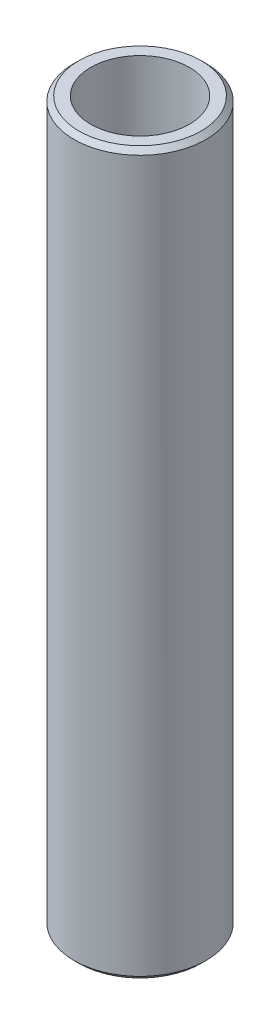
ISO-10303-21;
HEADER;
FILE_DESCRIPTION(('STEP AP214'),'2;1');
FILE_NAME('part.step','',(''),(''),'','','');
FILE_SCHEMA(('AUTOMOTIVE_DESIGN { 1 0 10303 214 1 1 1 1 }'));
ENDSEC;
DATA;
#1=APPLICATION_CONTEXT('core data for automotive mechanical design processes');
#2=APPLICATION_PROTOCOL_DEFINITION('international standard','automotive_design',2000,#1);
#3=PRODUCT_CONTEXT('',#1,'mechanical');
#4=PRODUCT('Part','Part','',(#3));
#5=PRODUCT_RELATED_PRODUCT_CATEGORY('part','',(#4));
#6=PRODUCT_DEFINITION_FORMATION('','',#4);
#7=PRODUCT_DEFINITION_CONTEXT('part definition',#1,'design');
#8=PRODUCT_DEFINITION('design','',#6,#7);
#9=PRODUCT_DEFINITION_SHAPE('','',#8);
#10=(LENGTH_UNIT() NAMED_UNIT(*) SI_UNIT(.MILLI.,.METRE.));
#11=(NAMED_UNIT(*) PLANE_ANGLE_UNIT() SI_UNIT($,.RADIAN.));
#12=(NAMED_UNIT(*) SI_UNIT($,.STERADIAN.) SOLID_ANGLE_UNIT());
#13=UNCERTAINTY_MEASURE_WITH_UNIT(LENGTH_MEASURE(1.E-05),#10,'distance_accuracy_value','');
#14=(GEOMETRIC_REPRESENTATION_CONTEXT(3) GLOBAL_UNCERTAINTY_ASSIGNED_CONTEXT((#13)) GLOBAL_UNIT_ASSIGNED_CONTEXT((#10,
#11,#12)) REPRESENTATION_CONTEXT('',''));
#15=CARTESIAN_POINT('',(0.,0.,0.));
#16=DIRECTION('',(0.,0.,1.));
#17=DIRECTION('',(1.,0.,0.));
#18=AXIS2_PLACEMENT_3D('',#15,#16,#17);
#19=CARTESIAN_POINT('',(0.,491.695548874802,0.));
#20=DIRECTION('',(0.,-1.,0.));
#21=DIRECTION('',(0.,0.,-1.));
#22=AXIS2_PLACEMENT_3D('',#19,#20,#21);
#23=CYLINDRICAL_SURFACE('',#22,45.);
#24=CARTESIAN_POINT('',(0.,488.3638529157,0.));
#25=DIRECTION('',(0.,1.,0.));
#26=DIRECTION('',(0.,0.,1.));
#27=AXIS2_PLACEMENT_3D('',#24,#25,#26);
#28=CIRCLE('',#27,45.);
#29=CARTESIAN_POINT('',(0.,488.3638529157,-45.));
#30=VERTEX_POINT('',#29);
#31=EDGE_CURVE('E50',#30,#30,#28,.F.);
#32=CARTESIAN_POINT('',(0.,3.33169595910243,0.));
#33=DIRECTION('',(0.,1.,0.));
#34=DIRECTION('',(0.,0.,1.));
#35=AXIS2_PLACEMENT_3D('',#32,#33,#34);
#36=CIRCLE('',#35,45.);
#37=CARTESIAN_POINT('',(0.,3.33169595910243,-45.));
#38=VERTEX_POINT('',#37);
#39=EDGE_CURVE('E51',#38,#38,#36,.T.);
#40=CARTESIAN_POINT('',(0.,488.3638529157,-45.));
#41=CARTESIAN_POINT('',(0.,483.311434614068,-45.));
#42=CARTESIAN_POINT('',(0.,478.259016312437,-45.));
#43=CARTESIAN_POINT('',(0.,468.154179709175,-45.));
#44=CARTESIAN_POINT('',(0.,463.101761407544,-45.));
#45=CARTESIAN_POINT('',(0.,452.996924804281,-45.));
#46=CARTESIAN_POINT('',(0.,447.94450650265,-45.));
#47=CARTESIAN_POINT('',(0.,437.839669899388,-45.));
#48=CARTESIAN_POINT('',(0.,432.787251597756,-45.));
#49=CARTESIAN_POINT('',(0.,422.682414994494,-45.));
#50=CARTESIAN_POINT('',(0.,417.629996692863,-45.));
#51=CARTESIAN_POINT('',(0.,407.5251600896,-45.));
#52=CARTESIAN_POINT('',(0.,402.472741787969,-45.));
#53=CARTESIAN_POINT('',(0.,392.367905184707,-45.));
#54=CARTESIAN_POINT('',(0.,387.315486883075,-45.));
#55=CARTESIAN_POINT('',(0.,377.210650279813,-45.));
#56=CARTESIAN_POINT('',(0.,372.158231978182,-45.));
#57=CARTESIAN_POINT('',(0.,362.053395374919,-45.));
#58=CARTESIAN_POINT('',(0.,357.000977073288,-45.));
#59=CARTESIAN_POINT('',(0.,346.896140470026,-45.));
#60=CARTESIAN_POINT('',(0.,341.843722168394,-45.));
#61=CARTESIAN_POINT('',(0.,331.738885565132,-45.));
#62=CARTESIAN_POINT('',(0.,326.686467263501,-45.));
#63=CARTESIAN_POINT('',(0.,316.581630660238,-45.));
#64=CARTESIAN_POINT('',(0.,311.529212358607,-45.));
#65=CARTESIAN_POINT('',(0.,301.424375755345,-45.));
#66=CARTESIAN_POINT('',(0.,296.371957453713,-45.));
#67=CARTESIAN_POINT('',(0.,286.267120850451,-45.));
#68=CARTESIAN_POINT('',(0.,281.21470254882,-45.));
#69=CARTESIAN_POINT('',(0.,271.109865945557,-45.));
#70=CARTESIAN_POINT('',(0.,266.057447643926,-45.));
#71=CARTESIAN_POINT('',(0.,255.952611040664,-45.));
#72=CARTESIAN_POINT('',(0.,250.900192739032,-45.));
#73=CARTESIAN_POINT('',(0.,240.79535613577,-45.));
#74=CARTESIAN_POINT('',(0.,235.742937834139,-45.));
#75=CARTESIAN_POINT('',(0.,225.638101230876,-45.));
#76=CARTESIAN_POINT('',(0.,220.585682929245,-45.));
#77=CARTESIAN_POINT('',(0.,210.480846325983,-45.));
#78=CARTESIAN_POINT('',(0.,205.428428024351,-45.));
#79=CARTESIAN_POINT('',(0.,195.323591421089,-45.));
#80=CARTESIAN_POINT('',(0.,190.271173119458,-45.));
#81=CARTESIAN_POINT('',(0.,180.166336516195,-45.));
#82=CARTESIAN_POINT('',(0.,175.113918214564,-45.));
#83=CARTESIAN_POINT('',(0.,165.009081611302,-45.));
#84=CARTESIAN_POINT('',(0.,159.95666330967,-45.));
#85=CARTESIAN_POINT('',(0.,149.851826706408,-45.));
#86=CARTESIAN_POINT('',(0.,144.799408404777,-45.));
#87=CARTESIAN_POINT('',(0.,134.694571801514,-45.));
#88=CARTESIAN_POINT('',(0.,129.642153499883,-45.));
#89=CARTESIAN_POINT('',(0.,119.537316896621,-45.));
#90=CARTESIAN_POINT('',(0.,114.484898594989,-45.));
#91=CARTESIAN_POINT('',(0.,104.380061991727,-45.));
#92=CARTESIAN_POINT('',(0.,99.3276436900957,-45.));
#93=CARTESIAN_POINT('',(0.,89.2228070868332,-45.));
#94=CARTESIAN_POINT('',(0.,84.170388785202,-45.));
#95=CARTESIAN_POINT('',(0.,74.0655521819396,-45.));
#96=CARTESIAN_POINT('',(0.,69.0131338803083,-45.));
#97=CARTESIAN_POINT('',(0.,58.9082972770459,-45.));
#98=CARTESIAN_POINT('',(0.,53.8558789754147,-45.));
#99=CARTESIAN_POINT('',(0.,43.7510423721522,-45.));
#100=CARTESIAN_POINT('',(0.,38.698624070521,-45.));
#101=CARTESIAN_POINT('',(0.,28.5937874672585,-45.));
#102=CARTESIAN_POINT('',(0.,23.5413691656273,-45.));
#103=CARTESIAN_POINT('',(0.,13.4365325623649,-45.));
#104=CARTESIAN_POINT('',(0.,8.38411426073365,-45.));
#105=CARTESIAN_POINT('',(0.,3.33169595910243,-45.));
#106=B_SPLINE_CURVE_WITH_KNOTS('',3,(#40,#41,#42,#43,#44,#45,#46,#47,#48,#49,#50,#51,#52,#53,
#54,#55,#56,#57,#58,#59,#60,#61,#62,#63,#64,#65,#66,#67,#68,#69,#70,#71,#72,#73,#74,#75,#76,#77,
#78,#79,#80,#81,#82,#83,#84,#85,#86,#87,#88,#89,#90,#91,#92,#93,#94,#95,#96,#97,#98,#99,#100,
#101,#102,#103,#104,#105),.UNSPECIFIED.,.F.,.F.,(4,2,2,2,2,2,2,2,2,2,2,2,2,2,2,2,2,2,2,2,2,2,2,
2,2,2,2,2,2,2,2,2,4),(0.,15.1572549048936,30.3145098097873,45.471764714681,60.6290196195746,
75.7862745244683,90.943529429362,106.100784334256,121.258039239149,136.415294144043,
151.572549048937,166.72980395383,181.887058858724,197.044313763618,212.201568668511,
227.358823573405,242.516078478299,257.673333383192,272.830588288086,287.98784319298,
303.145098097873,318.302353002767,333.459607907661,348.616862812554,363.774117717448,
378.931372622342,394.088627527235,409.245882432129,424.403137337023,439.560392241916,
454.71764714681,469.874902051704,485.032156956597),.UNSPECIFIED.);
#107=EDGE_CURVE('BSEAM39',#30,#38,#106,.T.);
#108=ORIENTED_EDGE('',*,*,#31,.T.);
#109=ORIENTED_EDGE('',*,*,#39,.T.);
#110=ORIENTED_EDGE('',*,*,#107,.T.);
#111=ORIENTED_EDGE('',*,*,#107,.F.);
#112=EDGE_LOOP('',(#108,#110,#109,#111));
#113=FACE_BOUND('',#112,.T.);
#114=ADVANCED_FACE('F39',(#113),#23,.T.);
#115=CARTESIAN_POINT('',(0.,491.695548874802,0.));
#116=DIRECTION('',(0.,1.,0.));
#117=DIRECTION('',(0.,0.,1.));
#118=AXIS2_PLACEMENT_3D('',#115,#116,#117);
#119=PLANE('',#118);
#120=CARTESIAN_POINT('',(0.,491.695548874802,0.));
#121=DIRECTION('',(0.,1.,0.));
#122=DIRECTION('',(0.,0.,1.));
#123=AXIS2_PLACEMENT_3D('',#120,#121,#122);
#124=CIRCLE('',#123,41.6683040408982);
#125=CARTESIAN_POINT('',(0.,491.695548874801,-41.6683040408982));
#126=VERTEX_POINT('',#125);
#127=EDGE_CURVE('E54',#126,#126,#124,.T.);
#128=ORIENTED_EDGE('',*,*,#127,.T.);
#129=EDGE_LOOP('',(#128));
#130=FACE_BOUND('',#129,.T.);
#131=CARTESIAN_POINT('',(0.,491.695548874802,0.));
#132=DIRECTION('',(0.,1.,0.));
#133=DIRECTION('',(0.,0.,1.));
#134=AXIS2_PLACEMENT_3D('',#131,#132,#133);
#135=CIRCLE('',#134,33.6464691679005);
#136=CARTESIAN_POINT('',(0.,491.695548874802,-33.6464691679005));
#137=VERTEX_POINT('',#136);
#138=EDGE_CURVE('E58',#137,#137,#135,.T.);
#139=ORIENTED_EDGE('',*,*,#138,.F.);
#140=EDGE_LOOP('',(#139));
#141=FACE_BOUND('',#140,.T.);
#142=ADVANCED_FACE('F69',(#130,#141),#119,.T.);
#143=CARTESIAN_POINT('',(0.,0.,0.));
#144=DIRECTION('',(0.,1.,0.));
#145=DIRECTION('',(0.,0.,1.));
#146=AXIS2_PLACEMENT_3D('',#143,#144,#145);
#147=PLANE('',#146);
#148=CARTESIAN_POINT('',(0.,0.,0.));
#149=DIRECTION('',(0.,1.,0.));
#150=DIRECTION('',(0.,0.,1.));
#151=AXIS2_PLACEMENT_3D('',#148,#149,#150);
#152=CIRCLE('',#151,41.6683040408975);
#153=CARTESIAN_POINT('',(0.,0.,41.6683040408975));
#154=VERTEX_POINT('',#153);
#155=EDGE_CURVE('E10',#154,#154,#152,.F.);
#156=ORIENTED_EDGE('',*,*,#155,.T.);
#157=EDGE_LOOP('',(#156));
#158=FACE_BOUND('',#157,.T.);
#159=CARTESIAN_POINT('',(0.,0.,0.));
#160=DIRECTION('',(0.,1.,0.));
#161=DIRECTION('',(0.,0.,1.));
#162=AXIS2_PLACEMENT_3D('',#159,#160,#161);
#163=CIRCLE('',#162,33.6464691679005);
#164=CARTESIAN_POINT('',(0.,0.,-33.6464691679005));
#165=VERTEX_POINT('',#164);
#166=EDGE_CURVE('E63',#165,#165,#163,.T.);
#167=ORIENTED_EDGE('',*,*,#166,.T.);
#168=EDGE_LOOP('',(#167));
#169=FACE_BOUND('',#168,.T.);
#170=ADVANCED_FACE('F75',(#158,#169),#147,.F.);
#171=CARTESIAN_POINT('',(0.,491.695548874802,0.));
#172=DIRECTION('',(0.,-1.,0.));
#173=DIRECTION('',(0.,0.,-1.));
#174=AXIS2_PLACEMENT_3D('',#171,#172,#173);
#175=CYLINDRICAL_SURFACE('',#174,33.6464691679005);
#176=CARTESIAN_POINT('',(0.,491.695548874802,-33.6464691679005));
#177=CARTESIAN_POINT('',(0.,486.573720240689,-33.6464691679005));
#178=CARTESIAN_POINT('',(0.,481.451891606577,-33.6464691679005));
#179=CARTESIAN_POINT('',(0.,471.208234338351,-33.6464691679005));
#180=CARTESIAN_POINT('',(0.,466.086405704239,-33.6464691679005));
#181=CARTESIAN_POINT('',(0.,455.842748436014,-33.6464691679005));
#182=CARTESIAN_POINT('',(0.,450.720919801901,-33.6464691679005));
#183=CARTESIAN_POINT('',(0.,440.477262533676,-33.6464691679005));
#184=CARTESIAN_POINT('',(0.,435.355433899564,-33.6464691679005));
#185=CARTESIAN_POINT('',(0.,425.111776631339,-33.6464691679005));
#186=CARTESIAN_POINT('',(0.,419.989947997226,-33.6464691679005));
#187=CARTESIAN_POINT('',(0.,409.746290729001,-33.6464691679005));
#188=CARTESIAN_POINT('',(0.,404.624462094889,-33.6464691679005));
#189=CARTESIAN_POINT('',(0.,394.380804826664,-33.6464691679005));
#190=CARTESIAN_POINT('',(0.,389.258976192551,-33.6464691679005));
#191=CARTESIAN_POINT('',(0.,379.015318924326,-33.6464691679005));
#192=CARTESIAN_POINT('',(0.,373.893490290214,-33.6464691679005));
#193=CARTESIAN_POINT('',(0.,363.649833021989,-33.6464691679005));
#194=CARTESIAN_POINT('',(0.,358.528004387876,-33.6464691679005));
#195=CARTESIAN_POINT('',(0.,348.284347119651,-33.6464691679005));
#196=CARTESIAN_POINT('',(0.,343.162518485539,-33.6464691679005));
#197=CARTESIAN_POINT('',(0.,332.918861217314,-33.6464691679005));
#198=CARTESIAN_POINT('',(0.,327.797032583201,-33.6464691679005));
#199=CARTESIAN_POINT('',(0.,317.553375314976,-33.6464691679005));
#200=CARTESIAN_POINT('',(0.,312.431546680864,-33.6464691679005));
#201=CARTESIAN_POINT('',(0.,302.187889412638,-33.6464691679005));
#202=CARTESIAN_POINT('',(0.,297.066060778526,-33.6464691679005));
#203=CARTESIAN_POINT('',(0.,286.822403510301,-33.6464691679005));
#204=CARTESIAN_POINT('',(0.,281.700574876188,-33.6464691679005));
#205=CARTESIAN_POINT('',(0.,271.456917607963,-33.6464691679005));
#206=CARTESIAN_POINT('',(0.,266.335088973851,-33.6464691679005));
#207=CARTESIAN_POINT('',(0.,256.091431705626,-33.6464691679005));
#208=CARTESIAN_POINT('',(0.,250.969603071513,-33.6464691679005));
#209=CARTESIAN_POINT('',(0.,240.725945803288,-33.6464691679005));
#210=CARTESIAN_POINT('',(0.,235.604117169176,-33.6464691679005));
#211=CARTESIAN_POINT('',(0.,225.360459900951,-33.6464691679005));
#212=CARTESIAN_POINT('',(0.,220.238631266838,-33.6464691679005));
#213=CARTESIAN_POINT('',(0.,209.994973998613,-33.6464691679005));
#214=CARTESIAN_POINT('',(0.,204.873145364501,-33.6464691679005));
#215=CARTESIAN_POINT('',(0.,194.629488096276,-33.6464691679005));
#216=CARTESIAN_POINT('',(0.,189.507659462163,-33.6464691679005));
#217=CARTESIAN_POINT('',(0.,179.264002193938,-33.6464691679005));
#218=CARTESIAN_POINT('',(0.,174.142173559826,-33.6464691679005));
#219=CARTESIAN_POINT('',(0.,163.898516291601,-33.6464691679005));
#220=CARTESIAN_POINT('',(0.,158.776687657488,-33.6464691679005));
#221=CARTESIAN_POINT('',(0.,148.533030389263,-33.6464691679005));
#222=CARTESIAN_POINT('',(0.,143.41120175515,-33.6464691679005));
#223=CARTESIAN_POINT('',(0.,133.167544486925,-33.6464691679005));
#224=CARTESIAN_POINT('',(0.,128.045715852813,-33.6464691679005));
#225=CARTESIAN_POINT('',(0.,117.802058584588,-33.6464691679005));
#226=CARTESIAN_POINT('',(0.,112.680229950475,-33.6464691679005));
#227=CARTESIAN_POINT('',(0.,102.43657268225,-33.6464691679005));
#228=CARTESIAN_POINT('',(0.,97.3147440481378,-33.6464691679005));
#229=CARTESIAN_POINT('',(0.,87.0710867799128,-33.6464691679005));
#230=CARTESIAN_POINT('',(0.,81.9492581458003,-33.6464691679005));
#231=CARTESIAN_POINT('',(0.,71.7056008775752,-33.6464691679005));
#232=CARTESIAN_POINT('',(0.,66.5837722434627,-33.6464691679005));
#233=CARTESIAN_POINT('',(0.,56.3401149752377,-33.6464691679005));
#234=CARTESIAN_POINT('',(0.,51.2182863411252,-33.6464691679005));
#235=CARTESIAN_POINT('',(0.,40.9746290729001,-33.6464691679005));
#236=CARTESIAN_POINT('',(0.,35.8528004387876,-33.6464691679005));
#237=CARTESIAN_POINT('',(0.,25.6091431705626,-33.6464691679005));
#238=CARTESIAN_POINT('',(0.,20.4873145364501,-33.6464691679005));
#239=CARTESIAN_POINT('',(0.,10.243657268225,-33.6464691679005));
#240=CARTESIAN_POINT('',(0.,5.12182863411251,-33.6464691679005));
#241=CARTESIAN_POINT('',(0.,0.,-33.6464691679005));
#242=B_SPLINE_CURVE_WITH_KNOTS('',3,(#176,#177,#178,#179,#180,#181,#182,#183,#184,#185,#186,
#187,#188,#189,#190,#191,#192,#193,#194,#195,#196,#197,#198,#199,#200,#201,#202,#203,#204,#205,
#206,#207,#208,#209,#210,#211,#212,#213,#214,#215,#216,#217,#218,#219,#220,#221,#222,#223,#224,
#225,#226,#227,#228,#229,#230,#231,#232,#233,#234,#235,#236,#237,#238,#239,#240,#241),
.UNSPECIFIED.,.F.,.F.,(4,2,2,2,2,2,2,2,2,2,2,2,2,2,2,2,2,2,2,2,2,2,2,2,2,2,2,2,2,2,2,2,4),(0.,
15.3654859023376,30.7309718046751,46.0964577070126,61.4619436093502,76.8274295116878,
92.1929154140253,107.558401316363,122.9238872187,138.289373121038,153.654859023376,
169.020344925713,184.385830828051,199.751316730388,215.116802632726,230.482288535063,
245.847774437401,261.213260339738,276.578746242076,291.944232144413,307.309718046751,
322.675203949088,338.040689851426,353.406175753764,368.771661656101,384.137147558439,
399.502633460776,414.868119363114,430.233605265451,445.599091167789,460.964577070126,
476.330062972464,491.695548874802),.UNSPECIFIED.);
#243=EDGE_CURVE('BSEAM70',#137,#165,#242,.T.);
#244=ORIENTED_EDGE('',*,*,#138,.T.);
#245=ORIENTED_EDGE('',*,*,#166,.F.);
#246=ORIENTED_EDGE('',*,*,#243,.T.);
#247=ORIENTED_EDGE('',*,*,#243,.F.);
#248=EDGE_LOOP('',(#244,#246,#245,#247));
#249=FACE_BOUND('',#248,.T.);
#250=ADVANCED_FACE('F70',(#249),#175,.F.);
#251=CARTESIAN_POINT('',(0.,491.695548874802,0.));
#252=DIRECTION('',(0.,-1.,0.));
#253=DIRECTION('',(0.,0.,-1.));
#254=AXIS2_PLACEMENT_3D('',#251,#252,#253);
#255=CONICAL_SURFACE('',#254,41.6683040408982,0.785398163397452);
#256=CARTESIAN_POINT('',(0.,488.3638529157,-45.));
#257=CARTESIAN_POINT('',(0.,488.39855808194,-44.9652948337594));
#258=CARTESIAN_POINT('',(0.,488.433263248181,-44.9305896675188));
#259=CARTESIAN_POINT('',(0.,488.502673580662,-44.8611793350375));
#260=CARTESIAN_POINT('',(0.,488.537378746903,-44.8264741687968));
#261=CARTESIAN_POINT('',(0.,488.606789079384,-44.7570638363155));
#262=CARTESIAN_POINT('',(0.,488.641494245625,-44.7223586700749));
#263=CARTESIAN_POINT('',(0.,488.710904578106,-44.6529483375936));
#264=CARTESIAN_POINT('',(0.,488.745609744347,-44.618243171353));
#265=CARTESIAN_POINT('',(0.,488.815020076828,-44.5488328388717));
#266=CARTESIAN_POINT('',(0.,488.849725243069,-44.514127672631));
#267=CARTESIAN_POINT('',(0.,488.91913557555,-44.4447173401497));
#268=CARTESIAN_POINT('',(0.,488.953840741791,-44.4100121739091));
#269=CARTESIAN_POINT('',(0.,489.023251074272,-44.3406018414278));
#270=CARTESIAN_POINT('',(0.,489.057956240513,-44.3058966751872));
#271=CARTESIAN_POINT('',(0.,489.127366572994,-44.2364863427059));
#272=CARTESIAN_POINT('',(0.,489.162071739234,-44.2017811764652));
#273=CARTESIAN_POINT('',(0.,489.231482071716,-44.1323708439839));
#274=CARTESIAN_POINT('',(0.,489.266187237956,-44.0976656777433));
#275=CARTESIAN_POINT('',(0.,489.335597570438,-44.028255345262));
#276=CARTESIAN_POINT('',(0.,489.370302736678,-43.9935501790214));
#277=CARTESIAN_POINT('',(0.,489.43971306916,-43.9241398465401));
#278=CARTESIAN_POINT('',(0.,489.4744182354,-43.8894346802994));
#279=CARTESIAN_POINT('',(0.,489.543828567882,-43.8200243478181));
#280=CARTESIAN_POINT('',(0.,489.578533734122,-43.7853191815775));
#281=CARTESIAN_POINT('',(0.,489.647944066604,-43.7159088490962));
#282=CARTESIAN_POINT('',(0.,489.682649232844,-43.6812036828556));
#283=CARTESIAN_POINT('',(0.,489.752059565325,-43.6117933503743));
#284=CARTESIAN_POINT('',(0.,489.786764731566,-43.5770881841336));
#285=CARTESIAN_POINT('',(0.,489.856175064047,-43.5076778516523));
#286=CARTESIAN_POINT('',(0.,489.890880230288,-43.4729726854117));
#287=CARTESIAN_POINT('',(0.,489.960290562769,-43.4035623529304));
#288=CARTESIAN_POINT('',(0.,489.99499572901,-43.3688571866898));
#289=CARTESIAN_POINT('',(0.,490.064406061491,-43.2994468542085));
#290=CARTESIAN_POINT('',(0.,490.099111227732,-43.2647416879678));
#291=CARTESIAN_POINT('',(0.,490.168521560213,-43.1953313554865));
#292=CARTESIAN_POINT('',(0.,490.203226726454,-43.1606261892459));
#293=CARTESIAN_POINT('',(0.,490.272637058935,-43.0912158567646));
#294=CARTESIAN_POINT('',(0.,490.307342225176,-43.056510690524));
#295=CARTESIAN_POINT('',(0.,490.376752557657,-42.9871003580427));
#296=CARTESIAN_POINT('',(0.,490.411457723898,-42.952395191802));
#297=CARTESIAN_POINT('',(0.,490.480868056379,-42.8829848593207));
#298=CARTESIAN_POINT('',(0.,490.51557322262,-42.8482796930801));
#299=CARTESIAN_POINT('',(0.,490.584983555101,-42.7788693605988));
#300=CARTESIAN_POINT('',(0.,490.619688721342,-42.7441641943582));
#301=CARTESIAN_POINT('',(0.,490.689099053823,-42.6747538618769));
#302=CARTESIAN_POINT('',(0.,490.723804220063,-42.6400486956362));
#303=CARTESIAN_POINT('',(0.,490.793214552545,-42.5706383631549));
#304=CARTESIAN_POINT('',(0.,490.827919718785,-42.5359331969143));
#305=CARTESIAN_POINT('',(0.,490.897330051267,-42.466522864433));
#306=CARTESIAN_POINT('',(0.,490.932035217507,-42.4318176981924));
#307=CARTESIAN_POINT('',(0.,491.001445549989,-42.3624073657111));
#308=CARTESIAN_POINT('',(0.,491.036150716229,-42.3277021994704));
#309=CARTESIAN_POINT('',(0.,491.105561048711,-42.2582918669891));
#310=CARTESIAN_POINT('',(0.,491.140266214951,-42.2235867007485));
#311=CARTESIAN_POINT('',(0.,491.209676547433,-42.1541763682672));
#312=CARTESIAN_POINT('',(0.,491.244381713673,-42.1194712020266));
#313=CARTESIAN_POINT('',(0.,491.313792046154,-42.0500608695453));
#314=CARTESIAN_POINT('',(0.,491.348497212395,-42.0153557033046));
#315=CARTESIAN_POINT('',(0.,491.417907544876,-41.9459453708233));
#316=CARTESIAN_POINT('',(0.,491.452612711117,-41.9112402045827));
#317=CARTESIAN_POINT('',(0.,491.522023043598,-41.8418298721014));
#318=CARTESIAN_POINT('',(0.,491.556728209839,-41.8071247058608));
#319=CARTESIAN_POINT('',(0.,491.62613854232,-41.7377143733795));
#320=CARTESIAN_POINT('',(0.,491.660843708561,-41.7030092071388));
#321=CARTESIAN_POINT('',(0.,491.695548874802,-41.6683040408982));
#322=B_SPLINE_CURVE_WITH_KNOTS('',3,(#256,#257,#258,#259,#260,#261,#262,#263,#264,#265,#266,
#267,#268,#269,#270,#271,#272,#273,#274,#275,#276,#277,#278,#279,#280,#281,#282,#283,#284,#285,
#286,#287,#288,#289,#290,#291,#292,#293,#294,#295,#296,#297,#298,#299,#300,#301,#302,#303,#304,
#305,#306,#307,#308,#309,#310,#311,#312,#313,#314,#315,#316,#317,#318,#319,#320,#321),
.UNSPECIFIED.,.F.,.F.,(4,2,2,2,2,2,2,2,2,2,2,2,2,2,2,2,2,2,2,2,2,2,2,2,2,2,2,2,2,2,2,2,4),(0.,
0.147241550345822,0.294483100691604,0.441724651037426,0.588966201383204,0.736207751728986,
0.883449302074808,1.03069085242059,1.17793240276637,1.32517395311219,1.47241550345798,
1.61965705380376,1.76689860414958,1.91414015449536,2.06138170484114,2.20862325518696,
2.35586480553275,2.50310635587853,2.65034790622435,2.79758945657013,2.94483100691591,
3.09207255726173,3.23931410760751,3.3865556579533,3.53379720829912,3.6810387586449,
3.82828030899068,3.97552185933651,4.12276340968229,4.27000496002807,4.41724651037389,
4.56448806071967,4.71172961106549),.UNSPECIFIED.);
#323=EDGE_CURVE('BSEAM81',#30,#126,#322,.T.);
#324=ORIENTED_EDGE('',*,*,#31,.F.);
#325=ORIENTED_EDGE('',*,*,#127,.F.);
#326=ORIENTED_EDGE('',*,*,#323,.T.);
#327=ORIENTED_EDGE('',*,*,#323,.F.);
#328=EDGE_LOOP('',(#324,#326,#325,#327));
#329=FACE_BOUND('',#328,.T.);
#330=ADVANCED_FACE('F81',(#329),#255,.T.);
#331=CARTESIAN_POINT('',(0.,3.33169595910243,0.));
#332=DIRECTION('',(0.,1.,0.));
#333=DIRECTION('',(0.,0.,1.));
#334=AXIS2_PLACEMENT_3D('',#331,#332,#333);
#335=CONICAL_SURFACE('',#334,45.,0.785398163397452);
#336=ORIENTED_EDGE('',*,*,#155,.F.);
#337=EDGE_LOOP('',(#336));
#338=FACE_BOUND('',#337,.T.);
#339=ORIENTED_EDGE('',*,*,#39,.F.);
#340=EDGE_LOOP('',(#339));
#341=FACE_BOUND('',#340,.T.);
#342=ADVANCED_FACE('F45',(#338,#341),#335,.T.);
#343=CLOSED_SHELL('',(#114,#142,#170,#250,#330,#342));
#344=MANIFOLD_SOLID_BREP('B2',#343);
#345=ADVANCED_BREP_SHAPE_REPRESENTATION('',(#18,#344),#14);
#346=SHAPE_DEFINITION_REPRESENTATION(#9,#345);
ENDSEC;
END-ISO-10303-21;
